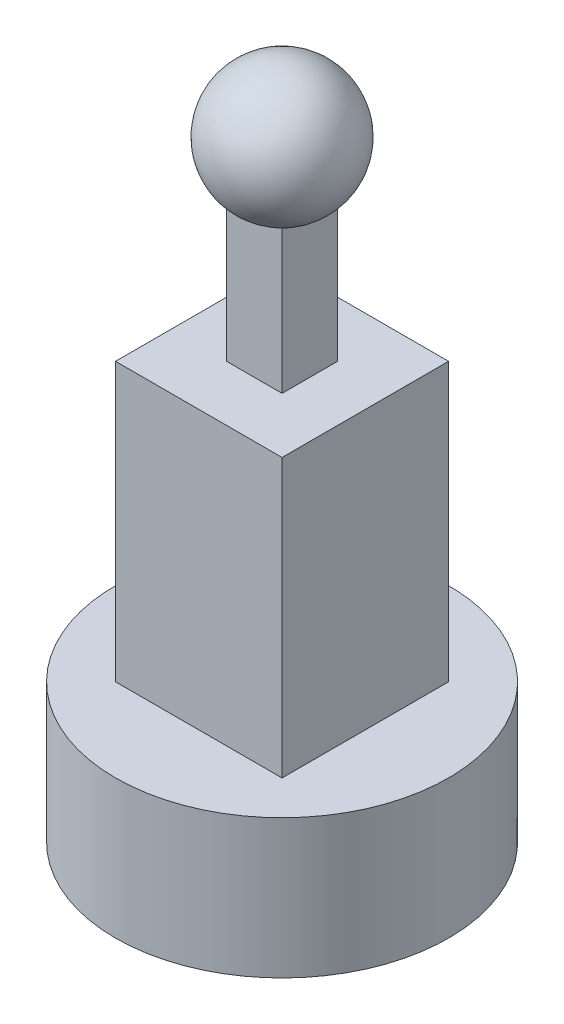
ISO-10303-21;
HEADER;
FILE_DESCRIPTION(('STEP AP214'),'2;1');
FILE_NAME('part.step','',(''),(''),'','','');
FILE_SCHEMA(('AUTOMOTIVE_DESIGN { 1 0 10303 214 1 1 1 1 }'));
ENDSEC;
DATA;
#1=APPLICATION_CONTEXT('core data for automotive mechanical design processes');
#2=APPLICATION_PROTOCOL_DEFINITION('international standard','automotive_design',2000,#1);
#3=PRODUCT_CONTEXT('',#1,'mechanical');
#4=PRODUCT('Part','Part','',(#3));
#5=PRODUCT_RELATED_PRODUCT_CATEGORY('part','',(#4));
#6=PRODUCT_DEFINITION_FORMATION('','',#4);
#7=PRODUCT_DEFINITION_CONTEXT('part definition',#1,'design');
#8=PRODUCT_DEFINITION('design','',#6,#7);
#9=PRODUCT_DEFINITION_SHAPE('','',#8);
#10=(LENGTH_UNIT() NAMED_UNIT(*) SI_UNIT(.MILLI.,.METRE.));
#11=(NAMED_UNIT(*) PLANE_ANGLE_UNIT() SI_UNIT($,.RADIAN.));
#12=(NAMED_UNIT(*) SI_UNIT($,.STERADIAN.) SOLID_ANGLE_UNIT());
#13=UNCERTAINTY_MEASURE_WITH_UNIT(LENGTH_MEASURE(1.E-05),#10,'distance_accuracy_value','');
#14=(GEOMETRIC_REPRESENTATION_CONTEXT(3) GLOBAL_UNCERTAINTY_ASSIGNED_CONTEXT((#13)) GLOBAL_UNIT_ASSIGNED_CONTEXT((#10,
#11,#12)) REPRESENTATION_CONTEXT('',''));
#15=CARTESIAN_POINT('',(0.,0.,0.));
#16=DIRECTION('',(0.,0.,1.));
#17=DIRECTION('',(1.,0.,0.));
#18=AXIS2_PLACEMENT_3D('',#15,#16,#17);
#19=CARTESIAN_POINT('',(0.,75.,0.));
#20=DIRECTION('',(0.,-1.,0.));
#21=DIRECTION('',(0.,0.,-1.));
#22=AXIS2_PLACEMENT_3D('',#19,#20,#21);
#23=PLANE('',#22);
#24=DIRECTION('',(0.,0.,1.));
#25=VECTOR('',#24,1.);
#26=CARTESIAN_POINT('',(-15.,75.,15.));
#27=LINE('',#26,#25);
#28=CARTESIAN_POINT('',(-15.,75.,-15.));
#29=VERTEX_POINT('',#28);
#30=CARTESIAN_POINT('',(-15.,75.,15.));
#31=VERTEX_POINT('',#30);
#32=EDGE_CURVE('E140',#29,#31,#27,.T.);
#33=ORIENTED_EDGE('',*,*,#32,.T.);
#34=DIRECTION('',(1.,0.,0.));
#35=VECTOR('',#34,1.);
#36=CARTESIAN_POINT('',(15.,75.,15.));
#37=LINE('',#36,#35);
#38=CARTESIAN_POINT('',(15.,75.,15.));
#39=VERTEX_POINT('',#38);
#40=EDGE_CURVE('E143',#31,#39,#37,.T.);
#41=ORIENTED_EDGE('',*,*,#40,.T.);
#42=DIRECTION('',(0.,0.,-1.));
#43=VECTOR('',#42,1.);
#44=CARTESIAN_POINT('',(15.,75.,-15.));
#45=LINE('',#44,#43);
#46=CARTESIAN_POINT('',(15.,75.,-15.));
#47=VERTEX_POINT('',#46);
#48=EDGE_CURVE('E146',#39,#47,#45,.T.);
#49=ORIENTED_EDGE('',*,*,#48,.T.);
#50=DIRECTION('',(-1.,0.,0.));
#51=VECTOR('',#50,1.);
#52=CARTESIAN_POINT('',(-15.,75.,-15.));
#53=LINE('',#52,#51);
#54=EDGE_CURVE('E148',#47,#29,#53,.T.);
#55=ORIENTED_EDGE('',*,*,#54,.T.);
#56=EDGE_LOOP('',(#33,#41,#49,#55));
#57=FACE_BOUND('',#56,.T.);
#58=DIRECTION('',(0.,0.,1.));
#59=VECTOR('',#58,1.);
#60=CARTESIAN_POINT('',(-5.,75.,5.));
#61=LINE('',#60,#59);
#62=CARTESIAN_POINT('',(-5.,75.,-5.));
#63=VERTEX_POINT('',#62);
#64=CARTESIAN_POINT('',(-5.,75.,5.));
#65=VERTEX_POINT('',#64);
#66=EDGE_CURVE('E121',#63,#65,#61,.T.);
#67=ORIENTED_EDGE('',*,*,#66,.F.);
#68=DIRECTION('',(-1.,0.,0.));
#69=VECTOR('',#68,1.);
#70=CARTESIAN_POINT('',(-5.,75.,-5.));
#71=LINE('',#70,#69);
#72=CARTESIAN_POINT('',(5.,75.,-5.));
#73=VERTEX_POINT('',#72);
#74=EDGE_CURVE('E110',#73,#63,#71,.T.);
#75=ORIENTED_EDGE('',*,*,#74,.F.);
#76=DIRECTION('',(0.,0.,-1.));
#77=VECTOR('',#76,1.);
#78=CARTESIAN_POINT('',(5.,75.,-5.));
#79=LINE('',#78,#77);
#80=CARTESIAN_POINT('',(5.,75.,5.));
#81=VERTEX_POINT('',#80);
#82=EDGE_CURVE('E131',#81,#73,#79,.T.);
#83=ORIENTED_EDGE('',*,*,#82,.F.);
#84=DIRECTION('',(1.,0.,0.));
#85=VECTOR('',#84,1.);
#86=CARTESIAN_POINT('',(5.,75.,5.));
#87=LINE('',#86,#85);
#88=EDGE_CURVE('E128',#65,#81,#87,.T.);
#89=ORIENTED_EDGE('',*,*,#88,.F.);
#90=EDGE_LOOP('',(#67,#75,#83,#89));
#91=FACE_BOUND('',#90,.T.);
#92=ADVANCED_FACE('F41',(#57,#91),#23,.F.);
#93=CARTESIAN_POINT('',(0.,25.,0.));
#94=DIRECTION('',(0.,-1.,0.));
#95=DIRECTION('',(0.,0.,-1.));
#96=AXIS2_PLACEMENT_3D('',#93,#94,#95);
#97=CYLINDRICAL_SURFACE('',#96,30.);
#98=CARTESIAN_POINT('',(0.,25.,0.));
#99=DIRECTION('',(0.,1.,0.));
#100=DIRECTION('',(0.,0.,1.));
#101=AXIS2_PLACEMENT_3D('',#98,#99,#100);
#102=CIRCLE('',#101,30.);
#103=CARTESIAN_POINT('',(0.,25.,30.));
#104=VERTEX_POINT('',#103);
#105=EDGE_CURVE('E49',#104,#104,#102,.T.);
#106=ORIENTED_EDGE('',*,*,#105,.F.);
#107=EDGE_LOOP('',(#106));
#108=FACE_BOUND('',#107,.T.);
#109=CARTESIAN_POINT('',(0.,0.,0.));
#110=DIRECTION('',(0.,1.,0.));
#111=DIRECTION('',(0.,0.,1.));
#112=AXIS2_PLACEMENT_3D('',#109,#110,#111);
#113=CIRCLE('',#112,30.);
#114=CARTESIAN_POINT('',(0.,0.,30.));
#115=VERTEX_POINT('',#114);
#116=EDGE_CURVE('E173',#115,#115,#113,.T.);
#117=ORIENTED_EDGE('',*,*,#116,.T.);
#118=EDGE_LOOP('',(#117));
#119=FACE_BOUND('',#118,.T.);
#120=ADVANCED_FACE('F43',(#108,#119),#97,.T.);
#121=CARTESIAN_POINT('',(0.,25.,0.));
#122=DIRECTION('',(0.,1.,0.));
#123=DIRECTION('',(0.,0.,1.));
#124=AXIS2_PLACEMENT_3D('',#121,#122,#123);
#125=PLANE('',#124);
#126=DIRECTION('',(1.,0.,0.));
#127=VECTOR('',#126,1.);
#128=CARTESIAN_POINT('',(15.,25.,15.));
#129=LINE('',#128,#127);
#130=CARTESIAN_POINT('',(-15.,25.,15.));
#131=VERTEX_POINT('',#130);
#132=CARTESIAN_POINT('',(15.,25.,15.));
#133=VERTEX_POINT('',#132);
#134=EDGE_CURVE('E139',#131,#133,#129,.T.);
#135=ORIENTED_EDGE('',*,*,#134,.F.);
#136=DIRECTION('',(0.,0.,1.));
#137=VECTOR('',#136,1.);
#138=CARTESIAN_POINT('',(-15.,25.,-0.769018565524844));
#139=LINE('',#138,#137);
#140=CARTESIAN_POINT('',(-15.,25.,-15.));
#141=VERTEX_POINT('',#140);
#142=EDGE_CURVE('E144',#141,#131,#139,.T.);
#143=ORIENTED_EDGE('',*,*,#142,.F.);
#144=DIRECTION('',(-1.,0.,0.));
#145=VECTOR('',#144,1.);
#146=CARTESIAN_POINT('',(-15.,25.,-15.));
#147=LINE('',#146,#145);
#148=CARTESIAN_POINT('',(15.,25.,-15.));
#149=VERTEX_POINT('',#148);
#150=EDGE_CURVE('E157',#149,#141,#147,.T.);
#151=ORIENTED_EDGE('',*,*,#150,.F.);
#152=DIRECTION('',(0.,0.,-1.));
#153=VECTOR('',#152,1.);
#154=CARTESIAN_POINT('',(15.,25.,-15.));
#155=LINE('',#154,#153);
#156=EDGE_CURVE('E154',#133,#149,#155,.T.);
#157=ORIENTED_EDGE('',*,*,#156,.F.);
#158=EDGE_LOOP('',(#135,#143,#151,#157));
#159=FACE_BOUND('',#158,.T.);
#160=ORIENTED_EDGE('',*,*,#105,.T.);
#161=EDGE_LOOP('',(#160));
#162=FACE_BOUND('',#161,.T.);
#163=ADVANCED_FACE('F182',(#159,#162),#125,.T.);
#164=CARTESIAN_POINT('',(0.,0.,0.));
#165=DIRECTION('',(0.,1.,0.));
#166=DIRECTION('',(0.,0.,1.));
#167=AXIS2_PLACEMENT_3D('',#164,#165,#166);
#168=PLANE('',#167);
#169=ORIENTED_EDGE('',*,*,#116,.F.);
#170=EDGE_LOOP('',(#169));
#171=FACE_BOUND('',#170,.T.);
#172=ADVANCED_FACE('F179',(#171),#168,.F.);
#173=CARTESIAN_POINT('',(15.,75.,15.));
#174=DIRECTION('',(0.,0.,-1.));
#175=DIRECTION('',(-1.,0.,0.));
#176=AXIS2_PLACEMENT_3D('',#173,#174,#175);
#177=PLANE('',#176);
#178=ORIENTED_EDGE('',*,*,#134,.T.);
#179=DIRECTION('',(0.,-1.,0.));
#180=VECTOR('',#179,1.);
#181=CARTESIAN_POINT('',(15.,75.,15.));
#182=LINE('',#181,#180);
#183=EDGE_CURVE('E167',#39,#133,#182,.T.);
#184=ORIENTED_EDGE('',*,*,#183,.F.);
#185=ORIENTED_EDGE('',*,*,#40,.F.);
#186=DIRECTION('',(0.,-1.,0.));
#187=VECTOR('',#186,1.);
#188=CARTESIAN_POINT('',(-15.,75.,15.));
#189=LINE('',#188,#187);
#190=EDGE_CURVE('E170',#31,#131,#189,.T.);
#191=ORIENTED_EDGE('',*,*,#190,.T.);
#192=EDGE_LOOP('',(#178,#184,#185,#191));
#193=FACE_BOUND('',#192,.T.);
#194=ADVANCED_FACE('F181',(#193),#177,.F.);
#195=CARTESIAN_POINT('',(15.,75.,-15.));
#196=DIRECTION('',(-1.,0.,0.));
#197=DIRECTION('',(0.,0.,1.));
#198=AXIS2_PLACEMENT_3D('',#195,#196,#197);
#199=PLANE('',#198);
#200=ORIENTED_EDGE('',*,*,#156,.T.);
#201=DIRECTION('',(0.,-1.,0.));
#202=VECTOR('',#201,1.);
#203=CARTESIAN_POINT('',(15.,75.,-15.));
#204=LINE('',#203,#202);
#205=EDGE_CURVE('E164',#47,#149,#204,.T.);
#206=ORIENTED_EDGE('',*,*,#205,.F.);
#207=ORIENTED_EDGE('',*,*,#48,.F.);
#208=ORIENTED_EDGE('',*,*,#183,.T.);
#209=EDGE_LOOP('',(#200,#206,#207,#208));
#210=FACE_BOUND('',#209,.T.);
#211=ADVANCED_FACE('F187',(#210),#199,.F.);
#212=CARTESIAN_POINT('',(-15.,75.,-15.));
#213=DIRECTION('',(0.,0.,1.));
#214=DIRECTION('',(1.,0.,0.));
#215=AXIS2_PLACEMENT_3D('',#212,#213,#214);
#216=PLANE('',#215);
#217=ORIENTED_EDGE('',*,*,#150,.T.);
#218=DIRECTION('',(0.,-1.,0.));
#219=VECTOR('',#218,1.);
#220=CARTESIAN_POINT('',(-15.,75.,-15.));
#221=LINE('',#220,#219);
#222=EDGE_CURVE('E151',#29,#141,#221,.T.);
#223=ORIENTED_EDGE('',*,*,#222,.F.);
#224=ORIENTED_EDGE('',*,*,#54,.F.);
#225=ORIENTED_EDGE('',*,*,#205,.T.);
#226=EDGE_LOOP('',(#217,#223,#224,#225));
#227=FACE_BOUND('',#226,.T.);
#228=ADVANCED_FACE('F206',(#227),#216,.F.);
#229=CARTESIAN_POINT('',(-15.,75.,-0.769018565524844));
#230=DIRECTION('',(1.,0.,0.));
#231=DIRECTION('',(0.,0.,-1.));
#232=AXIS2_PLACEMENT_3D('',#229,#230,#231);
#233=PLANE('',#232);
#234=ORIENTED_EDGE('',*,*,#142,.T.);
#235=ORIENTED_EDGE('',*,*,#190,.F.);
#236=ORIENTED_EDGE('',*,*,#32,.F.);
#237=ORIENTED_EDGE('',*,*,#222,.T.);
#238=EDGE_LOOP('',(#234,#235,#236,#237));
#239=FACE_BOUND('',#238,.T.);
#240=ADVANCED_FACE('F203',(#239),#233,.F.);
#241=CARTESIAN_POINT('',(-5.,105.,5.));
#242=DIRECTION('',(1.,0.,0.));
#243=DIRECTION('',(0.,0.,-1.));
#244=AXIS2_PLACEMENT_3D('',#241,#242,#243);
#245=PLANE('',#244);
#246=CARTESIAN_POINT('',(-5.,110.,0.));
#247=DIRECTION('',(1.,0.,0.));
#248=DIRECTION('',(0.,0.,-1.));
#249=AXIS2_PLACEMENT_3D('',#246,#247,#248);
#250=CIRCLE('',#249,10.4737882403764);
#251=CARTESIAN_POINT('',(-5.,100.796726663613,-5.));
#252=VERTEX_POINT('',#251);
#253=CARTESIAN_POINT('',(-5.,100.796726663613,5.));
#254=VERTEX_POINT('',#253);
#255=EDGE_CURVE('E117',#252,#254,#250,.F.);
#256=ORIENTED_EDGE('',*,*,#255,.F.);
#257=DIRECTION('',(0.,-1.,0.));
#258=VECTOR('',#257,1.);
#259=CARTESIAN_POINT('',(-5.,105.,-5.));
#260=LINE('',#259,#258);
#261=EDGE_CURVE('E106',#252,#63,#260,.T.);
#262=ORIENTED_EDGE('',*,*,#261,.T.);
#263=ORIENTED_EDGE('',*,*,#66,.T.);
#264=DIRECTION('',(0.,-1.,0.));
#265=VECTOR('',#264,1.);
#266=CARTESIAN_POINT('',(-5.,105.,5.));
#267=LINE('',#266,#265);
#268=EDGE_CURVE('E119',#254,#65,#267,.T.);
#269=ORIENTED_EDGE('',*,*,#268,.F.);
#270=EDGE_LOOP('',(#256,#262,#263,#269));
#271=FACE_BOUND('',#270,.T.);
#272=ADVANCED_FACE('F118',(#271),#245,.F.);
#273=CARTESIAN_POINT('',(5.,105.,5.));
#274=DIRECTION('',(0.,0.,-1.));
#275=DIRECTION('',(-1.,0.,0.));
#276=AXIS2_PLACEMENT_3D('',#273,#274,#275);
#277=PLANE('',#276);
#278=CARTESIAN_POINT('',(0.,110.,5.));
#279=DIRECTION('',(0.,0.,-1.));
#280=DIRECTION('',(-1.,0.,0.));
#281=AXIS2_PLACEMENT_3D('',#278,#279,#280);
#282=CIRCLE('',#281,10.4737882403764);
#283=CARTESIAN_POINT('',(5.,100.796726663613,5.));
#284=VERTEX_POINT('',#283);
#285=EDGE_CURVE('E56',#254,#284,#282,.F.);
#286=ORIENTED_EDGE('',*,*,#285,.F.);
#287=ORIENTED_EDGE('',*,*,#268,.T.);
#288=ORIENTED_EDGE('',*,*,#88,.T.);
#289=DIRECTION('',(0.,-1.,0.));
#290=VECTOR('',#289,1.);
#291=CARTESIAN_POINT('',(5.,105.,5.));
#292=LINE('',#291,#290);
#293=EDGE_CURVE('E136',#284,#81,#292,.T.);
#294=ORIENTED_EDGE('',*,*,#293,.F.);
#295=EDGE_LOOP('',(#286,#287,#288,#294));
#296=FACE_BOUND('',#295,.T.);
#297=ADVANCED_FACE('F239',(#296),#277,.F.);
#298=CARTESIAN_POINT('',(5.,105.,-5.));
#299=DIRECTION('',(-1.,0.,0.));
#300=DIRECTION('',(0.,0.,1.));
#301=AXIS2_PLACEMENT_3D('',#298,#299,#300);
#302=PLANE('',#301);
#303=CARTESIAN_POINT('',(5.,110.,0.));
#304=DIRECTION('',(-1.,0.,0.));
#305=DIRECTION('',(0.,0.,1.));
#306=AXIS2_PLACEMENT_3D('',#303,#304,#305);
#307=CIRCLE('',#306,10.4737882403764);
#308=CARTESIAN_POINT('',(5.,100.796726663613,-5.));
#309=VERTEX_POINT('',#308);
#310=EDGE_CURVE('E64',#284,#309,#307,.F.);
#311=ORIENTED_EDGE('',*,*,#310,.F.);
#312=ORIENTED_EDGE('',*,*,#293,.T.);
#313=ORIENTED_EDGE('',*,*,#82,.T.);
#314=DIRECTION('',(0.,-1.,0.));
#315=VECTOR('',#314,1.);
#316=CARTESIAN_POINT('',(5.,105.,-5.));
#317=LINE('',#316,#315);
#318=EDGE_CURVE('E114',#309,#73,#317,.T.);
#319=ORIENTED_EDGE('',*,*,#318,.F.);
#320=EDGE_LOOP('',(#311,#312,#313,#319));
#321=FACE_BOUND('',#320,.T.);
#322=ADVANCED_FACE('F245',(#321),#302,.F.);
#323=CARTESIAN_POINT('',(-5.,105.,-5.));
#324=DIRECTION('',(0.,0.,1.));
#325=DIRECTION('',(1.,0.,0.));
#326=AXIS2_PLACEMENT_3D('',#323,#324,#325);
#327=PLANE('',#326);
#328=CARTESIAN_POINT('',(0.,110.,-5.));
#329=DIRECTION('',(0.,0.,1.));
#330=DIRECTION('',(1.,0.,0.));
#331=AXIS2_PLACEMENT_3D('',#328,#329,#330);
#332=CIRCLE('',#331,10.4737882403764);
#333=EDGE_CURVE('E11',#309,#252,#332,.F.);
#334=ORIENTED_EDGE('',*,*,#333,.F.);
#335=ORIENTED_EDGE('',*,*,#318,.T.);
#336=ORIENTED_EDGE('',*,*,#74,.T.);
#337=ORIENTED_EDGE('',*,*,#261,.F.);
#338=EDGE_LOOP('',(#334,#335,#336,#337));
#339=FACE_BOUND('',#338,.T.);
#340=ADVANCED_FACE('F108',(#339),#327,.F.);
#341=CARTESIAN_POINT('',(0.,110.,0.));
#342=DIRECTION('',(0.,0.,-1.));
#343=DIRECTION('',(1.,0.,0.));
#344=AXIS2_PLACEMENT_3D('',#341,#342,#343);
#345=SPHERICAL_SURFACE('',#344,11.6060432579);
#346=ORIENTED_EDGE('',*,*,#333,.T.);
#347=ORIENTED_EDGE('',*,*,#255,.T.);
#348=ORIENTED_EDGE('',*,*,#285,.T.);
#349=ORIENTED_EDGE('',*,*,#310,.T.);
#350=EDGE_LOOP('',(#346,#347,#348,#349));
#351=FACE_BOUND('',#350,.T.);
#352=ADVANCED_FACE('F123',(#351),#345,.T.);
#353=CLOSED_SHELL('',(#92,#120,#163,#172,#194,#211,#228,#240,#272,#297,#322,#340,#352));
#354=MANIFOLD_SOLID_BREP('B2',#353);
#355=ADVANCED_BREP_SHAPE_REPRESENTATION('',(#18,#354),#14);
#356=SHAPE_DEFINITION_REPRESENTATION(#9,#355);
ENDSEC;
END-ISO-10303-21;
